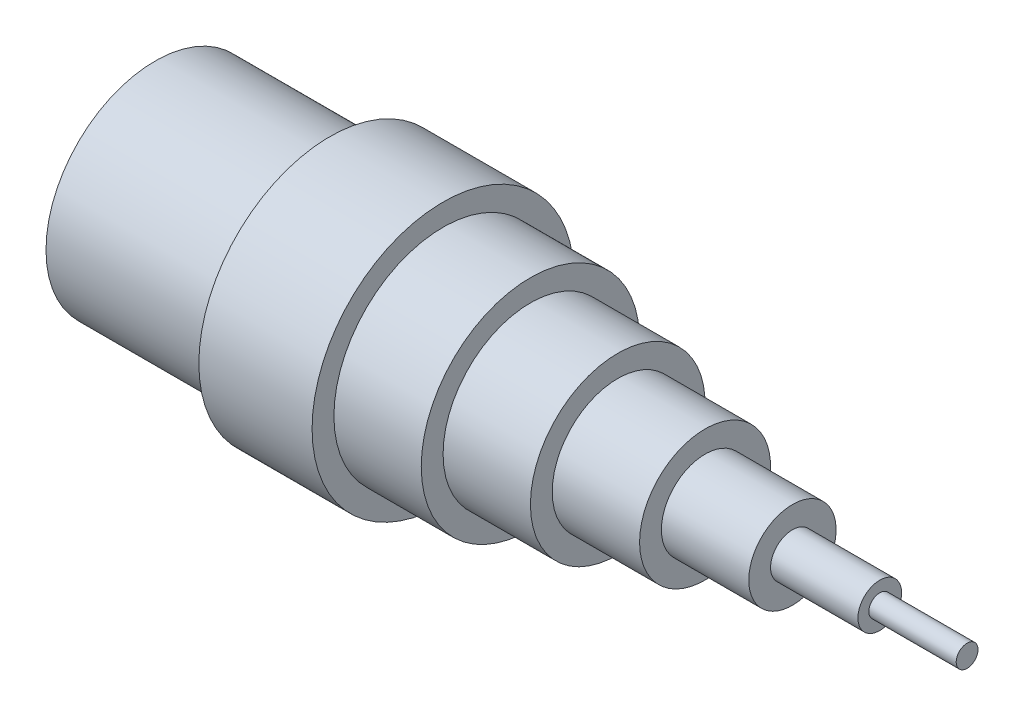
ISO-10303-21;
HEADER;
FILE_DESCRIPTION(('STEP AP214'),'2;1');
FILE_NAME('part.step','',(''),(''),'','','');
FILE_SCHEMA(('AUTOMOTIVE_DESIGN { 1 0 10303 214 1 1 1 1 }'));
ENDSEC;
DATA;
#1=APPLICATION_CONTEXT('core data for automotive mechanical design processes');
#2=APPLICATION_PROTOCOL_DEFINITION('international standard','automotive_design',2000,#1);
#3=PRODUCT_CONTEXT('',#1,'mechanical');
#4=PRODUCT('Part','Part','',(#3));
#5=PRODUCT_RELATED_PRODUCT_CATEGORY('part','',(#4));
#6=PRODUCT_DEFINITION_FORMATION('','',#4);
#7=PRODUCT_DEFINITION_CONTEXT('part definition',#1,'design');
#8=PRODUCT_DEFINITION('design','',#6,#7);
#9=PRODUCT_DEFINITION_SHAPE('','',#8);
#10=(LENGTH_UNIT() NAMED_UNIT(*) SI_UNIT(.MILLI.,.METRE.));
#11=(NAMED_UNIT(*) PLANE_ANGLE_UNIT() SI_UNIT($,.RADIAN.));
#12=(NAMED_UNIT(*) SI_UNIT($,.STERADIAN.) SOLID_ANGLE_UNIT());
#13=UNCERTAINTY_MEASURE_WITH_UNIT(LENGTH_MEASURE(1.E-05),#10,'distance_accuracy_value','');
#14=(GEOMETRIC_REPRESENTATION_CONTEXT(3) GLOBAL_UNCERTAINTY_ASSIGNED_CONTEXT((#13)) GLOBAL_UNIT_ASSIGNED_CONTEXT((#10,
#11,#12)) REPRESENTATION_CONTEXT('',''));
#15=CARTESIAN_POINT('',(0.,0.,0.));
#16=DIRECTION('',(0.,0.,1.));
#17=DIRECTION('',(1.,0.,0.));
#18=AXIS2_PLACEMENT_3D('',#15,#16,#17);
#19=CARTESIAN_POINT('',(0.,0.,0.));
#20=DIRECTION('',(-1.,0.,0.));
#21=DIRECTION('',(0.,0.,1.));
#22=AXIS2_PLACEMENT_3D('',#19,#20,#21);
#23=PLANE('',#22);
#24=CARTESIAN_POINT('',(0.,0.,0.));
#25=DIRECTION('',(-1.,0.,0.));
#26=DIRECTION('',(0.,0.,1.));
#27=AXIS2_PLACEMENT_3D('',#24,#25,#26);
#28=CIRCLE('',#27,14.6444080219794);
#29=CARTESIAN_POINT('',(0.,0.,14.6444080219794));
#30=VERTEX_POINT('',#29);
#31=EDGE_CURVE('E88',#30,#30,#28,.T.);
#32=ORIENTED_EDGE('',*,*,#31,.F.);
#33=EDGE_LOOP('',(#32));
#34=FACE_BOUND('',#33,.T.);
#35=CARTESIAN_POINT('',(0.,0.,0.));
#36=DIRECTION('',(-1.,0.,0.));
#37=DIRECTION('',(0.,0.,1.));
#38=AXIS2_PLACEMENT_3D('',#35,#36,#37);
#39=CIRCLE('',#38,25.);
#40=CARTESIAN_POINT('',(0.,0.,25.));
#41=VERTEX_POINT('',#40);
#42=EDGE_CURVE('E10',#41,#41,#39,.T.);
#43=ORIENTED_EDGE('',*,*,#42,.T.);
#44=EDGE_LOOP('',(#43));
#45=FACE_BOUND('',#44,.T.);
#46=ADVANCED_FACE('F32',(#34,#45),#23,.T.);
#47=CARTESIAN_POINT('',(0.,0.,0.));
#48=DIRECTION('',(-1.,0.,0.));
#49=DIRECTION('',(0.,0.,1.));
#50=AXIS2_PLACEMENT_3D('',#47,#48,#49);
#51=CYLINDRICAL_SURFACE('',#50,25.);
#52=CARTESIAN_POINT('',(40.,0.,0.));
#53=DIRECTION('',(-1.,0.,0.));
#54=DIRECTION('',(0.,0.,1.));
#55=AXIS2_PLACEMENT_3D('',#52,#53,#54);
#56=CIRCLE('',#55,25.);
#57=CARTESIAN_POINT('',(40.,0.,25.));
#58=VERTEX_POINT('',#57);
#59=EDGE_CURVE('E38',#58,#58,#56,.T.);
#60=ORIENTED_EDGE('',*,*,#59,.T.);
#61=EDGE_LOOP('',(#60));
#62=FACE_BOUND('',#61,.T.);
#63=ORIENTED_EDGE('',*,*,#42,.F.);
#64=EDGE_LOOP('',(#63));
#65=FACE_BOUND('',#64,.T.);
#66=ADVANCED_FACE('F104',(#62,#65),#51,.T.);
#67=CARTESIAN_POINT('',(40.,-25.,0.));
#68=DIRECTION('',(-1.,0.,0.));
#69=DIRECTION('',(0.,0.,1.));
#70=AXIS2_PLACEMENT_3D('',#67,#68,#69);
#71=PLANE('',#70);
#72=CARTESIAN_POINT('',(40.,0.,0.));
#73=DIRECTION('',(-1.,0.,0.));
#74=DIRECTION('',(0.,0.,1.));
#75=AXIS2_PLACEMENT_3D('',#72,#73,#74);
#76=CIRCLE('',#75,30.);
#77=CARTESIAN_POINT('',(40.,0.,30.));
#78=VERTEX_POINT('',#77);
#79=EDGE_CURVE('E42',#78,#78,#76,.T.);
#80=ORIENTED_EDGE('',*,*,#79,.T.);
#81=EDGE_LOOP('',(#80));
#82=FACE_BOUND('',#81,.T.);
#83=ORIENTED_EDGE('',*,*,#59,.F.);
#84=EDGE_LOOP('',(#83));
#85=FACE_BOUND('',#84,.T.);
#86=ADVANCED_FACE('F108',(#82,#85),#71,.T.);
#87=CARTESIAN_POINT('',(0.,0.,0.));
#88=DIRECTION('',(-1.,0.,0.));
#89=DIRECTION('',(0.,0.,1.));
#90=AXIS2_PLACEMENT_3D('',#87,#88,#89);
#91=CYLINDRICAL_SURFACE('',#90,30.);
#92=CARTESIAN_POINT('',(65.9305480566168,0.,0.));
#93=DIRECTION('',(-1.,0.,0.));
#94=DIRECTION('',(0.,0.,1.));
#95=AXIS2_PLACEMENT_3D('',#92,#93,#94);
#96=CIRCLE('',#95,30.);
#97=CARTESIAN_POINT('',(65.9305480566168,0.,30.));
#98=VERTEX_POINT('',#97);
#99=EDGE_CURVE('E46',#98,#98,#96,.T.);
#100=ORIENTED_EDGE('',*,*,#99,.T.);
#101=EDGE_LOOP('',(#100));
#102=FACE_BOUND('',#101,.T.);
#103=ORIENTED_EDGE('',*,*,#79,.F.);
#104=EDGE_LOOP('',(#103));
#105=FACE_BOUND('',#104,.T.);
#106=ADVANCED_FACE('F112',(#102,#105),#91,.T.);
#107=CARTESIAN_POINT('',(65.9305480566168,-30.,0.));
#108=DIRECTION('',(1.,0.,0.));
#109=DIRECTION('',(0.,0.,-1.));
#110=AXIS2_PLACEMENT_3D('',#107,#108,#109);
#111=PLANE('',#110);
#112=CARTESIAN_POINT('',(65.9305480566168,0.,0.));
#113=DIRECTION('',(-1.,0.,0.));
#114=DIRECTION('',(0.,0.,1.));
#115=AXIS2_PLACEMENT_3D('',#112,#113,#114);
#116=CIRCLE('',#115,25.);
#117=CARTESIAN_POINT('',(65.9305480566168,0.,25.));
#118=VERTEX_POINT('',#117);
#119=EDGE_CURVE('E51',#118,#118,#116,.T.);
#120=ORIENTED_EDGE('',*,*,#119,.T.);
#121=EDGE_LOOP('',(#120));
#122=FACE_BOUND('',#121,.T.);
#123=ORIENTED_EDGE('',*,*,#99,.F.);
#124=EDGE_LOOP('',(#123));
#125=FACE_BOUND('',#124,.T.);
#126=ADVANCED_FACE('F119',(#122,#125),#111,.T.);
#127=CARTESIAN_POINT('',(0.,0.,0.));
#128=DIRECTION('',(-1.,0.,0.));
#129=DIRECTION('',(0.,0.,1.));
#130=AXIS2_PLACEMENT_3D('',#127,#128,#129);
#131=CYLINDRICAL_SURFACE('',#130,25.);
#132=CARTESIAN_POINT('',(85.9305480566168,0.,0.));
#133=DIRECTION('',(-1.,0.,0.));
#134=DIRECTION('',(0.,0.,1.));
#135=AXIS2_PLACEMENT_3D('',#132,#133,#134);
#136=CIRCLE('',#135,25.);
#137=CARTESIAN_POINT('',(85.9305480566168,0.,25.));
#138=VERTEX_POINT('',#137);
#139=EDGE_CURVE('E54',#138,#138,#136,.T.);
#140=ORIENTED_EDGE('',*,*,#139,.T.);
#141=EDGE_LOOP('',(#140));
#142=FACE_BOUND('',#141,.T.);
#143=ORIENTED_EDGE('',*,*,#119,.F.);
#144=EDGE_LOOP('',(#143));
#145=FACE_BOUND('',#144,.T.);
#146=ADVANCED_FACE('F123',(#142,#145),#131,.T.);
#147=CARTESIAN_POINT('',(85.9305480566168,-25.,0.));
#148=DIRECTION('',(1.,0.,0.));
#149=DIRECTION('',(0.,0.,-1.));
#150=AXIS2_PLACEMENT_3D('',#147,#148,#149);
#151=PLANE('',#150);
#152=CARTESIAN_POINT('',(85.9305480566168,0.,0.));
#153=DIRECTION('',(-1.,0.,0.));
#154=DIRECTION('',(0.,0.,1.));
#155=AXIS2_PLACEMENT_3D('',#152,#153,#154);
#156=CIRCLE('',#155,20.);
#157=CARTESIAN_POINT('',(85.9305480566168,0.,20.));
#158=VERTEX_POINT('',#157);
#159=EDGE_CURVE('E57',#158,#158,#156,.T.);
#160=ORIENTED_EDGE('',*,*,#159,.T.);
#161=EDGE_LOOP('',(#160));
#162=FACE_BOUND('',#161,.T.);
#163=ORIENTED_EDGE('',*,*,#139,.F.);
#164=EDGE_LOOP('',(#163));
#165=FACE_BOUND('',#164,.T.);
#166=ADVANCED_FACE('F127',(#162,#165),#151,.T.);
#167=CARTESIAN_POINT('',(0.,0.,0.));
#168=DIRECTION('',(-1.,0.,0.));
#169=DIRECTION('',(0.,0.,1.));
#170=AXIS2_PLACEMENT_3D('',#167,#168,#169);
#171=CYLINDRICAL_SURFACE('',#170,20.);
#172=CARTESIAN_POINT('',(105.930548056617,0.,0.));
#173=DIRECTION('',(-1.,0.,0.));
#174=DIRECTION('',(0.,0.,1.));
#175=AXIS2_PLACEMENT_3D('',#172,#173,#174);
#176=CIRCLE('',#175,20.);
#177=CARTESIAN_POINT('',(105.930548056617,0.,20.));
#178=VERTEX_POINT('',#177);
#179=EDGE_CURVE('E60',#178,#178,#176,.T.);
#180=ORIENTED_EDGE('',*,*,#179,.T.);
#181=EDGE_LOOP('',(#180));
#182=FACE_BOUND('',#181,.T.);
#183=ORIENTED_EDGE('',*,*,#159,.F.);
#184=EDGE_LOOP('',(#183));
#185=FACE_BOUND('',#184,.T.);
#186=ADVANCED_FACE('F131',(#182,#185),#171,.T.);
#187=CARTESIAN_POINT('',(105.930548056617,-20.,0.));
#188=DIRECTION('',(1.,0.,0.));
#189=DIRECTION('',(0.,0.,-1.));
#190=AXIS2_PLACEMENT_3D('',#187,#188,#189);
#191=PLANE('',#190);
#192=CARTESIAN_POINT('',(105.930548056617,0.,0.));
#193=DIRECTION('',(-1.,0.,0.));
#194=DIRECTION('',(0.,0.,1.));
#195=AXIS2_PLACEMENT_3D('',#192,#193,#194);
#196=CIRCLE('',#195,15.);
#197=CARTESIAN_POINT('',(105.930548056617,0.,15.));
#198=VERTEX_POINT('',#197);
#199=EDGE_CURVE('E63',#198,#198,#196,.T.);
#200=ORIENTED_EDGE('',*,*,#199,.T.);
#201=EDGE_LOOP('',(#200));
#202=FACE_BOUND('',#201,.T.);
#203=ORIENTED_EDGE('',*,*,#179,.F.);
#204=EDGE_LOOP('',(#203));
#205=FACE_BOUND('',#204,.T.);
#206=ADVANCED_FACE('F135',(#202,#205),#191,.T.);
#207=CARTESIAN_POINT('',(0.,0.,0.));
#208=DIRECTION('',(-1.,0.,0.));
#209=DIRECTION('',(0.,0.,1.));
#210=AXIS2_PLACEMENT_3D('',#207,#208,#209);
#211=CYLINDRICAL_SURFACE('',#210,15.);
#212=CARTESIAN_POINT('',(125.930548056617,0.,0.));
#213=DIRECTION('',(-1.,0.,0.));
#214=DIRECTION('',(0.,0.,1.));
#215=AXIS2_PLACEMENT_3D('',#212,#213,#214);
#216=CIRCLE('',#215,15.);
#217=CARTESIAN_POINT('',(125.930548056617,0.,15.));
#218=VERTEX_POINT('',#217);
#219=EDGE_CURVE('E66',#218,#218,#216,.T.);
#220=ORIENTED_EDGE('',*,*,#219,.T.);
#221=EDGE_LOOP('',(#220));
#222=FACE_BOUND('',#221,.T.);
#223=ORIENTED_EDGE('',*,*,#199,.F.);
#224=EDGE_LOOP('',(#223));
#225=FACE_BOUND('',#224,.T.);
#226=ADVANCED_FACE('F139',(#222,#225),#211,.T.);
#227=CARTESIAN_POINT('',(125.930548056617,-15.,0.));
#228=DIRECTION('',(1.,0.,0.));
#229=DIRECTION('',(0.,0.,-1.));
#230=AXIS2_PLACEMENT_3D('',#227,#228,#229);
#231=PLANE('',#230);
#232=CARTESIAN_POINT('',(125.930548056617,0.,0.));
#233=DIRECTION('',(-1.,0.,0.));
#234=DIRECTION('',(0.,0.,1.));
#235=AXIS2_PLACEMENT_3D('',#232,#233,#234);
#236=CIRCLE('',#235,10.);
#237=CARTESIAN_POINT('',(125.930548056617,0.,10.));
#238=VERTEX_POINT('',#237);
#239=EDGE_CURVE('E69',#238,#238,#236,.T.);
#240=ORIENTED_EDGE('',*,*,#239,.T.);
#241=EDGE_LOOP('',(#240));
#242=FACE_BOUND('',#241,.T.);
#243=ORIENTED_EDGE('',*,*,#219,.F.);
#244=EDGE_LOOP('',(#243));
#245=FACE_BOUND('',#244,.T.);
#246=ADVANCED_FACE('F143',(#242,#245),#231,.T.);
#247=CARTESIAN_POINT('',(0.,0.,0.));
#248=DIRECTION('',(-1.,0.,0.));
#249=DIRECTION('',(0.,0.,1.));
#250=AXIS2_PLACEMENT_3D('',#247,#248,#249);
#251=CYLINDRICAL_SURFACE('',#250,10.);
#252=CARTESIAN_POINT('',(145.930548056617,0.,0.));
#253=DIRECTION('',(-1.,0.,0.));
#254=DIRECTION('',(0.,0.,1.));
#255=AXIS2_PLACEMENT_3D('',#252,#253,#254);
#256=CIRCLE('',#255,10.);
#257=CARTESIAN_POINT('',(145.930548056617,0.,10.));
#258=VERTEX_POINT('',#257);
#259=EDGE_CURVE('E72',#258,#258,#256,.T.);
#260=ORIENTED_EDGE('',*,*,#259,.T.);
#261=EDGE_LOOP('',(#260));
#262=FACE_BOUND('',#261,.T.);
#263=ORIENTED_EDGE('',*,*,#239,.F.);
#264=EDGE_LOOP('',(#263));
#265=FACE_BOUND('',#264,.T.);
#266=ADVANCED_FACE('F147',(#262,#265),#251,.T.);
#267=CARTESIAN_POINT('',(145.930548056617,-10.,0.));
#268=DIRECTION('',(1.,0.,0.));
#269=DIRECTION('',(0.,0.,-1.));
#270=AXIS2_PLACEMENT_3D('',#267,#268,#269);
#271=PLANE('',#270);
#272=CARTESIAN_POINT('',(145.930548056617,0.,0.));
#273=DIRECTION('',(-1.,0.,0.));
#274=DIRECTION('',(0.,0.,1.));
#275=AXIS2_PLACEMENT_3D('',#272,#273,#274);
#276=CIRCLE('',#275,5.);
#277=CARTESIAN_POINT('',(145.930548056617,0.,5.));
#278=VERTEX_POINT('',#277);
#279=EDGE_CURVE('E75',#278,#278,#276,.T.);
#280=ORIENTED_EDGE('',*,*,#279,.T.);
#281=EDGE_LOOP('',(#280));
#282=FACE_BOUND('',#281,.T.);
#283=ORIENTED_EDGE('',*,*,#259,.F.);
#284=EDGE_LOOP('',(#283));
#285=FACE_BOUND('',#284,.T.);
#286=ADVANCED_FACE('F151',(#282,#285),#271,.T.);
#287=CARTESIAN_POINT('',(0.,0.,0.));
#288=DIRECTION('',(-1.,0.,0.));
#289=DIRECTION('',(0.,0.,1.));
#290=AXIS2_PLACEMENT_3D('',#287,#288,#289);
#291=CYLINDRICAL_SURFACE('',#290,5.);
#292=CARTESIAN_POINT('',(165.930548056617,0.,0.));
#293=DIRECTION('',(-1.,0.,0.));
#294=DIRECTION('',(0.,0.,1.));
#295=AXIS2_PLACEMENT_3D('',#292,#293,#294);
#296=CIRCLE('',#295,5.);
#297=CARTESIAN_POINT('',(165.930548056617,0.,5.));
#298=VERTEX_POINT('',#297);
#299=EDGE_CURVE('E78',#298,#298,#296,.T.);
#300=ORIENTED_EDGE('',*,*,#299,.T.);
#301=EDGE_LOOP('',(#300));
#302=FACE_BOUND('',#301,.T.);
#303=ORIENTED_EDGE('',*,*,#279,.F.);
#304=EDGE_LOOP('',(#303));
#305=FACE_BOUND('',#304,.T.);
#306=ADVANCED_FACE('F155',(#302,#305),#291,.T.);
#307=CARTESIAN_POINT('',(165.930548056617,-5.,0.));
#308=DIRECTION('',(1.,0.,0.));
#309=DIRECTION('',(0.,0.,-1.));
#310=AXIS2_PLACEMENT_3D('',#307,#308,#309);
#311=PLANE('',#310);
#312=CARTESIAN_POINT('',(165.930548056617,0.,0.));
#313=DIRECTION('',(-1.,0.,0.));
#314=DIRECTION('',(0.,0.,1.));
#315=AXIS2_PLACEMENT_3D('',#312,#313,#314);
#316=CIRCLE('',#315,2.5);
#317=CARTESIAN_POINT('',(165.930548056617,0.,2.5));
#318=VERTEX_POINT('',#317);
#319=EDGE_CURVE('E81',#318,#318,#316,.T.);
#320=ORIENTED_EDGE('',*,*,#319,.T.);
#321=EDGE_LOOP('',(#320));
#322=FACE_BOUND('',#321,.T.);
#323=ORIENTED_EDGE('',*,*,#299,.F.);
#324=EDGE_LOOP('',(#323));
#325=FACE_BOUND('',#324,.T.);
#326=ADVANCED_FACE('F159',(#322,#325),#311,.T.);
#327=CARTESIAN_POINT('',(0.,0.,0.));
#328=DIRECTION('',(-1.,0.,0.));
#329=DIRECTION('',(0.,0.,1.));
#330=AXIS2_PLACEMENT_3D('',#327,#328,#329);
#331=CYLINDRICAL_SURFACE('',#330,2.5);
#332=CARTESIAN_POINT('',(185.930548056617,0.,0.));
#333=DIRECTION('',(-1.,0.,0.));
#334=DIRECTION('',(0.,0.,1.));
#335=AXIS2_PLACEMENT_3D('',#332,#333,#334);
#336=CIRCLE('',#335,2.5);
#337=CARTESIAN_POINT('',(185.930548056617,0.,2.5));
#338=VERTEX_POINT('',#337);
#339=EDGE_CURVE('E84',#338,#338,#336,.T.);
#340=ORIENTED_EDGE('',*,*,#339,.T.);
#341=EDGE_LOOP('',(#340));
#342=FACE_BOUND('',#341,.T.);
#343=ORIENTED_EDGE('',*,*,#319,.F.);
#344=EDGE_LOOP('',(#343));
#345=FACE_BOUND('',#344,.T.);
#346=ADVANCED_FACE('F163',(#342,#345),#331,.T.);
#347=CARTESIAN_POINT('',(185.930548056617,-2.5,0.));
#348=DIRECTION('',(1.,0.,0.));
#349=DIRECTION('',(0.,0.,-1.));
#350=AXIS2_PLACEMENT_3D('',#347,#348,#349);
#351=PLANE('',#350);
#352=ORIENTED_EDGE('',*,*,#339,.F.);
#353=EDGE_LOOP('',(#352));
#354=FACE_BOUND('',#353,.T.);
#355=ADVANCED_FACE('F99',(#354),#351,.T.);
#356=CARTESIAN_POINT('',(40.,0.,0.));
#357=DIRECTION('',(-1.,0.,0.));
#358=DIRECTION('',(0.,0.,1.));
#359=AXIS2_PLACEMENT_3D('',#356,#357,#358);
#360=CYLINDRICAL_SURFACE('',#359,14.6444080219794);
#361=CARTESIAN_POINT('',(40.,0.,0.));
#362=DIRECTION('',(-1.,0.,0.));
#363=DIRECTION('',(0.,0.,1.));
#364=AXIS2_PLACEMENT_3D('',#361,#362,#363);
#365=CIRCLE('',#364,14.6444080219794);
#366=CARTESIAN_POINT('',(40.,0.,14.6444080219794));
#367=VERTEX_POINT('',#366);
#368=EDGE_CURVE('E87',#367,#367,#365,.T.);
#369=ORIENTED_EDGE('',*,*,#368,.F.);
#370=EDGE_LOOP('',(#369));
#371=FACE_BOUND('',#370,.T.);
#372=ORIENTED_EDGE('',*,*,#31,.T.);
#373=EDGE_LOOP('',(#372));
#374=FACE_BOUND('',#373,.T.);
#375=ADVANCED_FACE('F96',(#371,#374),#360,.F.);
#376=CARTESIAN_POINT('',(40.,0.,0.));
#377=DIRECTION('',(-1.,0.,0.));
#378=DIRECTION('',(0.,0.,1.));
#379=AXIS2_PLACEMENT_3D('',#376,#377,#378);
#380=PLANE('',#379);
#381=ORIENTED_EDGE('',*,*,#368,.T.);
#382=EDGE_LOOP('',(#381));
#383=FACE_BOUND('',#382,.T.);
#384=ADVANCED_FACE('F94',(#383),#380,.T.);
#385=CLOSED_SHELL('',(#46,#66,#86,#106,#126,#146,#166,#186,#206,#226,#246,#266,#286,#306,#326,
#346,#355,#375,#384));
#386=MANIFOLD_SOLID_BREP('B2',#385);
#387=ADVANCED_BREP_SHAPE_REPRESENTATION('',(#18,#386),#14);
#388=SHAPE_DEFINITION_REPRESENTATION(#9,#387);
ENDSEC;
END-ISO-10303-21;
